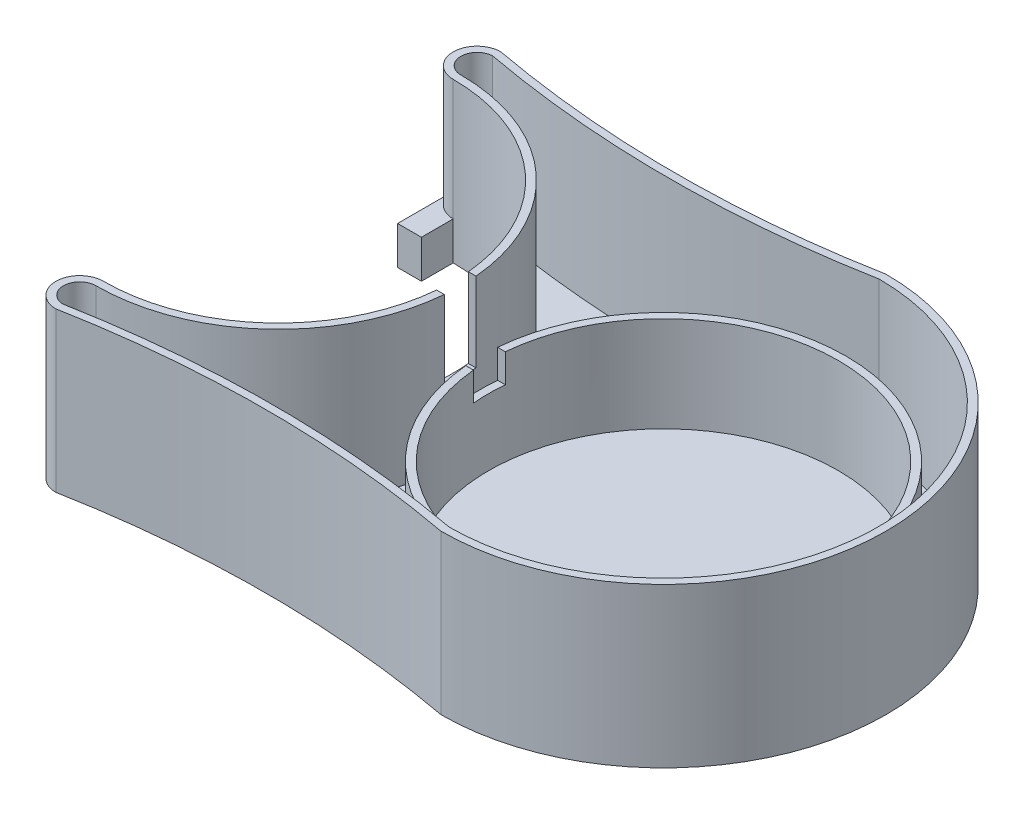
ISO-10303-21;
HEADER;
FILE_DESCRIPTION(('STEP AP214'),'2;1');
FILE_NAME('part.step','',(''),(''),'','','');
FILE_SCHEMA(('AUTOMOTIVE_DESIGN { 1 0 10303 214 1 1 1 1 }'));
ENDSEC;
DATA;
#1=APPLICATION_CONTEXT('core data for automotive mechanical design processes');
#2=APPLICATION_PROTOCOL_DEFINITION('international standard','automotive_design',2000,#1);
#3=PRODUCT_CONTEXT('',#1,'mechanical');
#4=PRODUCT('Part','Part','',(#3));
#5=PRODUCT_RELATED_PRODUCT_CATEGORY('part','',(#4));
#6=PRODUCT_DEFINITION_FORMATION('','',#4);
#7=PRODUCT_DEFINITION_CONTEXT('part definition',#1,'design');
#8=PRODUCT_DEFINITION('design','',#6,#7);
#9=PRODUCT_DEFINITION_SHAPE('','',#8);
#10=(LENGTH_UNIT() NAMED_UNIT(*) SI_UNIT(.MILLI.,.METRE.));
#11=(NAMED_UNIT(*) PLANE_ANGLE_UNIT() SI_UNIT($,.RADIAN.));
#12=(NAMED_UNIT(*) SI_UNIT($,.STERADIAN.) SOLID_ANGLE_UNIT());
#13=UNCERTAINTY_MEASURE_WITH_UNIT(LENGTH_MEASURE(1.E-05),#10,'distance_accuracy_value','');
#14=(GEOMETRIC_REPRESENTATION_CONTEXT(3) GLOBAL_UNCERTAINTY_ASSIGNED_CONTEXT((#13)) GLOBAL_UNIT_ASSIGNED_CONTEXT((#10,
#11,#12)) REPRESENTATION_CONTEXT('',''));
#15=CARTESIAN_POINT('',(0.,0.,0.));
#16=DIRECTION('',(0.,0.,1.));
#17=DIRECTION('',(1.,0.,0.));
#18=AXIS2_PLACEMENT_3D('',#15,#16,#17);
#19=CARTESIAN_POINT('',(-26.821298470149,0.,0.));
#20=DIRECTION('',(-1.,0.,0.));
#21=DIRECTION('',(0.,0.,1.));
#22=AXIS2_PLACEMENT_3D('',#19,#20,#21);
#23=PLANE('',#22);
#24=DIRECTION('',(0.,1.,0.));
#25=VECTOR('',#24,1.);
#26=CARTESIAN_POINT('',(-26.821298470149,0.,-22.5));
#27=LINE('',#26,#25);
#28=CARTESIAN_POINT('',(-26.821298470149,0.,-22.5));
#29=VERTEX_POINT('',#28);
#30=CARTESIAN_POINT('',(-26.821298470149,6.,-22.5));
#31=VERTEX_POINT('',#30);
#32=EDGE_CURVE('E50',#29,#31,#27,.T.);
#33=ORIENTED_EDGE('',*,*,#32,.T.);
#34=DIRECTION('',(0.,0.,1.));
#35=VECTOR('',#34,1.);
#36=CARTESIAN_POINT('',(-26.821298470149,6.,0.));
#37=LINE('',#36,#35);
#38=CARTESIAN_POINT('',(-26.821298470149,6.,-31.25));
#39=VERTEX_POINT('',#38);
#40=EDGE_CURVE('E63',#39,#31,#37,.T.);
#41=ORIENTED_EDGE('',*,*,#40,.F.);
#42=DIRECTION('',(0.,1.,0.));
#43=VECTOR('',#42,1.);
#44=CARTESIAN_POINT('',(-26.821298470149,0.,-31.25));
#45=LINE('',#44,#43);
#46=CARTESIAN_POINT('',(-26.821298470149,0.,-31.25));
#47=VERTEX_POINT('',#46);
#48=EDGE_CURVE('E12',#47,#39,#45,.T.);
#49=ORIENTED_EDGE('',*,*,#48,.F.);
#50=DIRECTION('',(0.,0.,1.));
#51=VECTOR('',#50,1.);
#52=CARTESIAN_POINT('',(-26.821298470149,0.,0.));
#53=LINE('',#52,#51);
#54=EDGE_CURVE('E114',#47,#29,#53,.T.);
#55=ORIENTED_EDGE('',*,*,#54,.T.);
#56=EDGE_LOOP('',(#33,#41,#49,#55));
#57=FACE_BOUND('',#56,.T.);
#58=ADVANCED_FACE('F47',(#57),#23,.T.);
#59=CARTESIAN_POINT('',(-23.071298470149,0.,-31.25));
#60=DIRECTION('',(0.,1.,0.));
#61=DIRECTION('',(0.,0.,1.));
#62=AXIS2_PLACEMENT_3D('',#59,#60,#61);
#63=CYLINDRICAL_SURFACE('',#62,3.75);
#64=CARTESIAN_POINT('',(-23.071298470149,6.,-31.25));
#65=DIRECTION('',(0.,1.,0.));
#66=DIRECTION('',(0.,0.,1.));
#67=AXIS2_PLACEMENT_3D('',#64,#65,#66);
#68=CIRCLE('',#67,3.75);
#69=CARTESIAN_POINT('',(-23.071298470149,6.,-27.5));
#70=VERTEX_POINT('',#69);
#71=EDGE_CURVE('E102',#39,#70,#68,.T.);
#72=ORIENTED_EDGE('',*,*,#71,.T.);
#73=DIRECTION('',(0.,1.,0.));
#74=VECTOR('',#73,1.);
#75=CARTESIAN_POINT('',(-23.071298470149,0.,-27.5));
#76=LINE('',#75,#74);
#77=CARTESIAN_POINT('',(-23.071298470149,0.,-27.5));
#78=VERTEX_POINT('',#77);
#79=EDGE_CURVE('E55',#78,#70,#76,.T.);
#80=ORIENTED_EDGE('',*,*,#79,.F.);
#81=CARTESIAN_POINT('',(-23.071298470149,0.,-31.25));
#82=DIRECTION('',(0.,1.,0.));
#83=DIRECTION('',(0.,0.,1.));
#84=AXIS2_PLACEMENT_3D('',#81,#82,#83);
#85=CIRCLE('',#84,3.75);
#86=EDGE_CURVE('E108',#47,#78,#85,.T.);
#87=ORIENTED_EDGE('',*,*,#86,.F.);
#88=ORIENTED_EDGE('',*,*,#48,.T.);
#89=EDGE_LOOP('',(#72,#80,#87,#88));
#90=FACE_BOUND('',#89,.T.);
#91=ADVANCED_FACE('F118',(#90),#63,.F.);
#92=CARTESIAN_POINT('',(-23.071298470149,0.,0.));
#93=DIRECTION('',(-1.,0.,0.));
#94=DIRECTION('',(0.,0.,1.));
#95=AXIS2_PLACEMENT_3D('',#92,#93,#94);
#96=PLANE('',#95);
#97=DIRECTION('',(0.,0.,1.));
#98=VECTOR('',#97,1.);
#99=CARTESIAN_POINT('',(-23.071298470149,6.,0.));
#100=LINE('',#99,#98);
#101=CARTESIAN_POINT('',(-23.071298470149,6.,-22.5));
#102=VERTEX_POINT('',#101);
#103=EDGE_CURVE('E88',#70,#102,#100,.T.);
#104=ORIENTED_EDGE('',*,*,#103,.T.);
#105=DIRECTION('',(0.,1.,0.));
#106=VECTOR('',#105,1.);
#107=CARTESIAN_POINT('',(-23.071298470149,0.,-22.5));
#108=LINE('',#107,#106);
#109=CARTESIAN_POINT('',(-23.071298470149,0.,-22.5));
#110=VERTEX_POINT('',#109);
#111=EDGE_CURVE('E99',#110,#102,#108,.T.);
#112=ORIENTED_EDGE('',*,*,#111,.F.);
#113=DIRECTION('',(0.,0.,1.));
#114=VECTOR('',#113,1.);
#115=CARTESIAN_POINT('',(-23.071298470149,0.,0.));
#116=LINE('',#115,#114);
#117=EDGE_CURVE('E111',#78,#110,#116,.T.);
#118=ORIENTED_EDGE('',*,*,#117,.F.);
#119=ORIENTED_EDGE('',*,*,#79,.T.);
#120=EDGE_LOOP('',(#104,#112,#118,#119));
#121=FACE_BOUND('',#120,.T.);
#122=ADVANCED_FACE('F97',(#121),#96,.F.);
#123=CARTESIAN_POINT('',(0.,0.,-22.5));
#124=DIRECTION('',(0.,0.,1.));
#125=DIRECTION('',(1.,0.,0.));
#126=AXIS2_PLACEMENT_3D('',#123,#124,#125);
#127=PLANE('',#126);
#128=ORIENTED_EDGE('',*,*,#111,.T.);
#129=DIRECTION('',(1.,0.,0.));
#130=VECTOR('',#129,1.);
#131=CARTESIAN_POINT('',(0.,6.,-22.5));
#132=LINE('',#131,#130);
#133=EDGE_CURVE('E85',#31,#102,#132,.T.);
#134=ORIENTED_EDGE('',*,*,#133,.F.);
#135=ORIENTED_EDGE('',*,*,#32,.F.);
#136=DIRECTION('',(1.,0.,0.));
#137=VECTOR('',#136,1.);
#138=CARTESIAN_POINT('',(0.,0.,-22.5));
#139=LINE('',#138,#137);
#140=EDGE_CURVE('E106',#29,#110,#139,.T.);
#141=ORIENTED_EDGE('',*,*,#140,.T.);
#142=EDGE_LOOP('',(#128,#134,#135,#141));
#143=FACE_BOUND('',#142,.T.);
#144=ADVANCED_FACE('F104',(#143),#127,.T.);
#145=CARTESIAN_POINT('',(0.,0.,0.));
#146=DIRECTION('',(0.,1.,0.));
#147=DIRECTION('',(0.,0.,1.));
#148=AXIS2_PLACEMENT_3D('',#145,#146,#147);
#149=PLANE('',#148);
#150=ORIENTED_EDGE('',*,*,#54,.F.);
#151=ORIENTED_EDGE('',*,*,#86,.T.);
#152=ORIENTED_EDGE('',*,*,#117,.T.);
#153=ORIENTED_EDGE('',*,*,#140,.F.);
#154=EDGE_LOOP('',(#150,#151,#152,#153));
#155=FACE_BOUND('',#154,.T.);
#156=ADVANCED_FACE('F121',(#155),#149,.F.);
#157=CARTESIAN_POINT('',(0.,6.,0.));
#158=DIRECTION('',(0.,1.,0.));
#159=DIRECTION('',(0.,0.,1.));
#160=AXIS2_PLACEMENT_3D('',#157,#158,#159);
#161=PLANE('',#160);
#162=ORIENTED_EDGE('',*,*,#40,.T.);
#163=ORIENTED_EDGE('',*,*,#133,.T.);
#164=ORIENTED_EDGE('',*,*,#103,.F.);
#165=ORIENTED_EDGE('',*,*,#71,.F.);
#166=EDGE_LOOP('',(#162,#163,#164,#165));
#167=FACE_BOUND('',#166,.T.);
#168=ADVANCED_FACE('F87',(#167),#161,.T.);
#169=CLOSED_SHELL('',(#58,#91,#122,#144,#156,#168));
#170=MANIFOLD_SOLID_BREP('B2',#169);
#171=CARTESIAN_POINT('',(-26.821298470149,0.,0.));
#172=DIRECTION('',(1.,0.,0.));
#173=DIRECTION('',(0.,0.,-1.));
#174=AXIS2_PLACEMENT_3D('',#171,#172,#173);
#175=PLANE('',#174);
#176=DIRECTION('',(0.,0.,-1.));
#177=VECTOR('',#176,1.);
#178=CARTESIAN_POINT('',(-26.821298470149,6.,0.));
#179=LINE('',#178,#177);
#180=CARTESIAN_POINT('',(-26.821298470149,6.,31.25));
#181=VERTEX_POINT('',#180);
#182=CARTESIAN_POINT('',(-26.821298470149,6.,22.5));
#183=VERTEX_POINT('',#182);
#184=EDGE_CURVE('E204',#181,#183,#179,.T.);
#185=ORIENTED_EDGE('',*,*,#184,.T.);
#186=DIRECTION('',(0.,1.,0.));
#187=VECTOR('',#186,1.);
#188=CARTESIAN_POINT('',(-26.821298470149,0.,22.5));
#189=LINE('',#188,#187);
#190=CARTESIAN_POINT('',(-26.821298470149,0.,22.5));
#191=VERTEX_POINT('',#190);
#192=EDGE_CURVE('E45',#191,#183,#189,.T.);
#193=ORIENTED_EDGE('',*,*,#192,.F.);
#194=DIRECTION('',(0.,0.,-1.));
#195=VECTOR('',#194,1.);
#196=CARTESIAN_POINT('',(-26.821298470149,0.,0.));
#197=LINE('',#196,#195);
#198=CARTESIAN_POINT('',(-26.821298470149,0.,31.25));
#199=VERTEX_POINT('',#198);
#200=EDGE_CURVE('E254',#199,#191,#197,.T.);
#201=ORIENTED_EDGE('',*,*,#200,.F.);
#202=DIRECTION('',(0.,1.,0.));
#203=VECTOR('',#202,1.);
#204=CARTESIAN_POINT('',(-26.821298470149,0.,31.25));
#205=LINE('',#204,#203);
#206=EDGE_CURVE('E191',#199,#181,#205,.T.);
#207=ORIENTED_EDGE('',*,*,#206,.T.);
#208=EDGE_LOOP('',(#185,#193,#201,#207));
#209=FACE_BOUND('',#208,.T.);
#210=ADVANCED_FACE('F188',(#209),#175,.F.);
#211=CARTESIAN_POINT('',(0.,0.,22.5));
#212=DIRECTION('',(0.,0.,1.));
#213=DIRECTION('',(1.,0.,0.));
#214=AXIS2_PLACEMENT_3D('',#211,#212,#213);
#215=PLANE('',#214);
#216=DIRECTION('',(1.,0.,0.));
#217=VECTOR('',#216,1.);
#218=CARTESIAN_POINT('',(0.,6.,22.5));
#219=LINE('',#218,#217);
#220=CARTESIAN_POINT('',(-23.071298470149,6.,22.5));
#221=VERTEX_POINT('',#220);
#222=EDGE_CURVE('E243',#183,#221,#219,.T.);
#223=ORIENTED_EDGE('',*,*,#222,.T.);
#224=DIRECTION('',(0.,1.,0.));
#225=VECTOR('',#224,1.);
#226=CARTESIAN_POINT('',(-23.071298470149,0.,22.5));
#227=LINE('',#226,#225);
#228=CARTESIAN_POINT('',(-23.071298470149,0.,22.5));
#229=VERTEX_POINT('',#228);
#230=EDGE_CURVE('E196',#229,#221,#227,.T.);
#231=ORIENTED_EDGE('',*,*,#230,.F.);
#232=DIRECTION('',(1.,0.,0.));
#233=VECTOR('',#232,1.);
#234=CARTESIAN_POINT('',(0.,0.,22.5));
#235=LINE('',#234,#233);
#236=EDGE_CURVE('E211',#191,#229,#235,.T.);
#237=ORIENTED_EDGE('',*,*,#236,.F.);
#238=ORIENTED_EDGE('',*,*,#192,.T.);
#239=EDGE_LOOP('',(#223,#231,#237,#238));
#240=FACE_BOUND('',#239,.T.);
#241=ADVANCED_FACE('F257',(#240),#215,.F.);
#242=CARTESIAN_POINT('',(-23.071298470149,0.,0.));
#243=DIRECTION('',(1.,0.,0.));
#244=DIRECTION('',(0.,0.,-1.));
#245=AXIS2_PLACEMENT_3D('',#242,#243,#244);
#246=PLANE('',#245);
#247=ORIENTED_EDGE('',*,*,#230,.T.);
#248=DIRECTION('',(0.,0.,-1.));
#249=VECTOR('',#248,1.);
#250=CARTESIAN_POINT('',(-23.071298470149,6.,0.));
#251=LINE('',#250,#249);
#252=CARTESIAN_POINT('',(-23.071298470149,6.,27.5));
#253=VERTEX_POINT('',#252);
#254=EDGE_CURVE('E230',#253,#221,#251,.T.);
#255=ORIENTED_EDGE('',*,*,#254,.F.);
#256=DIRECTION('',(0.,1.,0.));
#257=VECTOR('',#256,1.);
#258=CARTESIAN_POINT('',(-23.071298470149,0.,27.5));
#259=LINE('',#258,#257);
#260=CARTESIAN_POINT('',(-23.071298470149,0.,27.5));
#261=VERTEX_POINT('',#260);
#262=EDGE_CURVE('E241',#261,#253,#259,.T.);
#263=ORIENTED_EDGE('',*,*,#262,.F.);
#264=DIRECTION('',(0.,0.,-1.));
#265=VECTOR('',#264,1.);
#266=CARTESIAN_POINT('',(-23.071298470149,0.,0.));
#267=LINE('',#266,#265);
#268=EDGE_CURVE('E251',#261,#229,#267,.T.);
#269=ORIENTED_EDGE('',*,*,#268,.T.);
#270=EDGE_LOOP('',(#247,#255,#263,#269));
#271=FACE_BOUND('',#270,.T.);
#272=ADVANCED_FACE('F239',(#271),#246,.T.);
#273=CARTESIAN_POINT('',(-23.071298470149,0.,31.25));
#274=DIRECTION('',(0.,1.,0.));
#275=DIRECTION('',(0.,0.,1.));
#276=AXIS2_PLACEMENT_3D('',#273,#274,#275);
#277=CYLINDRICAL_SURFACE('',#276,3.75);
#278=CARTESIAN_POINT('',(-23.071298470149,6.,31.25));
#279=DIRECTION('',(0.,1.,0.));
#280=DIRECTION('',(0.,0.,1.));
#281=AXIS2_PLACEMENT_3D('',#278,#279,#280);
#282=CIRCLE('',#281,3.75);
#283=EDGE_CURVE('E227',#253,#181,#282,.T.);
#284=ORIENTED_EDGE('',*,*,#283,.T.);
#285=ORIENTED_EDGE('',*,*,#206,.F.);
#286=CARTESIAN_POINT('',(-23.071298470149,0.,31.25));
#287=DIRECTION('',(0.,1.,0.));
#288=DIRECTION('',(0.,0.,1.));
#289=AXIS2_PLACEMENT_3D('',#286,#287,#288);
#290=CIRCLE('',#289,3.75);
#291=EDGE_CURVE('E246',#261,#199,#290,.T.);
#292=ORIENTED_EDGE('',*,*,#291,.F.);
#293=ORIENTED_EDGE('',*,*,#262,.T.);
#294=EDGE_LOOP('',(#284,#285,#292,#293));
#295=FACE_BOUND('',#294,.T.);
#296=ADVANCED_FACE('F245',(#295),#277,.F.);
#297=CARTESIAN_POINT('',(0.,0.,0.));
#298=DIRECTION('',(0.,1.,0.));
#299=DIRECTION('',(0.,0.,1.));
#300=AXIS2_PLACEMENT_3D('',#297,#298,#299);
#301=PLANE('',#300);
#302=ORIENTED_EDGE('',*,*,#200,.T.);
#303=ORIENTED_EDGE('',*,*,#236,.T.);
#304=ORIENTED_EDGE('',*,*,#268,.F.);
#305=ORIENTED_EDGE('',*,*,#291,.T.);
#306=EDGE_LOOP('',(#302,#303,#304,#305));
#307=FACE_BOUND('',#306,.T.);
#308=ADVANCED_FACE('F262',(#307),#301,.F.);
#309=CARTESIAN_POINT('',(0.,6.,0.));
#310=DIRECTION('',(0.,1.,0.));
#311=DIRECTION('',(0.,0.,1.));
#312=AXIS2_PLACEMENT_3D('',#309,#310,#311);
#313=PLANE('',#312);
#314=ORIENTED_EDGE('',*,*,#283,.F.);
#315=ORIENTED_EDGE('',*,*,#254,.T.);
#316=ORIENTED_EDGE('',*,*,#222,.F.);
#317=ORIENTED_EDGE('',*,*,#184,.F.);
#318=EDGE_LOOP('',(#314,#315,#316,#317));
#319=FACE_BOUND('',#318,.T.);
#320=ADVANCED_FACE('F229',(#319),#313,.T.);
#321=CLOSED_SHELL('',(#210,#241,#272,#296,#308,#320));
#322=MANIFOLD_SOLID_BREP('B6',#321);
#323=CARTESIAN_POINT('',(37.5,25.,0.));
#324=DIRECTION('',(0.,-1.,0.));
#325=DIRECTION('',(0.,0.,-1.));
#326=AXIS2_PLACEMENT_3D('',#323,#324,#325);
#327=CYLINDRICAL_SURFACE('',#326,27.5);
#328=DIRECTION('',(0.,-1.,0.));
#329=VECTOR('',#328,1.);
#330=CARTESIAN_POINT('',(10.1138721247417,25.,2.5));
#331=LINE('',#330,#329);
#332=CARTESIAN_POINT('',(10.1138721247417,17.,2.5));
#333=VERTEX_POINT('',#332);
#334=CARTESIAN_POINT('',(10.1138721247417,12.5,2.5));
#335=VERTEX_POINT('',#334);
#336=EDGE_CURVE('E556',#333,#335,#331,.T.);
#337=ORIENTED_EDGE('',*,*,#336,.F.);
#338=CARTESIAN_POINT('',(37.5,17.,0.));
#339=DIRECTION('',(0.,1.,0.));
#340=DIRECTION('',(0.,0.,1.));
#341=AXIS2_PLACEMENT_3D('',#338,#339,#340);
#342=CIRCLE('',#341,27.5);
#343=CARTESIAN_POINT('',(10.1138721247417,17.,-2.5));
#344=VERTEX_POINT('',#343);
#345=EDGE_CURVE('E549',#333,#344,#342,.T.);
#346=ORIENTED_EDGE('',*,*,#345,.T.);
#347=DIRECTION('',(0.,-1.,0.));
#348=VECTOR('',#347,1.);
#349=CARTESIAN_POINT('',(10.1138721247417,25.,-2.5));
#350=LINE('',#349,#348);
#351=CARTESIAN_POINT('',(10.1138721247417,12.5,-2.5));
#352=VERTEX_POINT('',#351);
#353=EDGE_CURVE('E343',#352,#344,#350,.F.);
#354=ORIENTED_EDGE('',*,*,#353,.F.);
#355=CARTESIAN_POINT('',(37.5,12.5,0.));
#356=DIRECTION('',(0.,1.,0.));
#357=DIRECTION('',(0.,0.,1.));
#358=AXIS2_PLACEMENT_3D('',#355,#356,#357);
#359=CIRCLE('',#358,27.5);
#360=EDGE_CURVE('E567',#352,#335,#359,.T.);
#361=ORIENTED_EDGE('',*,*,#360,.T.);
#362=EDGE_LOOP('',(#337,#346,#354,#361));
#363=FACE_BOUND('',#362,.T.);
#364=CARTESIAN_POINT('',(37.5,2.,0.));
#365=DIRECTION('',(0.,-1.,0.));
#366=DIRECTION('',(0.,0.,-1.));
#367=AXIS2_PLACEMENT_3D('',#364,#365,#366);
#368=CIRCLE('',#367,27.5);
#369=CARTESIAN_POINT('',(37.5,2.,-27.5));
#370=VERTEX_POINT('',#369);
#371=EDGE_CURVE('E550',#370,#370,#368,.T.);
#372=ORIENTED_EDGE('',*,*,#371,.T.);
#373=EDGE_LOOP('',(#372));
#374=FACE_BOUND('',#373,.T.);
#375=ADVANCED_FACE('F320',(#363,#374),#327,.F.);
#376=CARTESIAN_POINT('',(37.5,25.,0.));
#377=DIRECTION('',(0.,-1.,0.));
#378=DIRECTION('',(0.,0.,-1.));
#379=AXIS2_PLACEMENT_3D('',#376,#377,#378);
#380=CYLINDRICAL_SURFACE('',#379,28.7);
#381=CARTESIAN_POINT('',(37.5,17.,0.));
#382=DIRECTION('',(0.,1.,0.));
#383=DIRECTION('',(0.,0.,1.));
#384=AXIS2_PLACEMENT_3D('',#381,#382,#383);
#385=CIRCLE('',#384,28.7);
#386=CARTESIAN_POINT('',(8.90909235438654,17.,2.5));
#387=VERTEX_POINT('',#386);
#388=CARTESIAN_POINT('',(8.90909235438654,17.,-2.5));
#389=VERTEX_POINT('',#388);
#390=EDGE_CURVE('E546',#387,#389,#385,.T.);
#391=ORIENTED_EDGE('',*,*,#390,.F.);
#392=DIRECTION('',(0.,-1.,0.));
#393=VECTOR('',#392,1.);
#394=CARTESIAN_POINT('',(8.90909235438654,25.,2.5));
#395=LINE('',#394,#393);
#396=CARTESIAN_POINT('',(8.90909235438654,12.5,2.5));
#397=VERTEX_POINT('',#396);
#398=EDGE_CURVE('E559',#387,#397,#395,.T.);
#399=ORIENTED_EDGE('',*,*,#398,.T.);
#400=CARTESIAN_POINT('',(37.5,12.5,0.));
#401=DIRECTION('',(0.,1.,0.));
#402=DIRECTION('',(0.,0.,1.));
#403=AXIS2_PLACEMENT_3D('',#400,#401,#402);
#404=CIRCLE('',#403,28.7);
#405=CARTESIAN_POINT('',(8.90909235438654,12.5,-2.5));
#406=VERTEX_POINT('',#405);
#407=EDGE_CURVE('E641',#406,#397,#404,.T.);
#408=ORIENTED_EDGE('',*,*,#407,.F.);
#409=DIRECTION('',(0.,-1.,0.));
#410=VECTOR('',#409,1.);
#411=CARTESIAN_POINT('',(8.90909235438654,25.,-2.5));
#412=LINE('',#411,#410);
#413=EDGE_CURVE('E710',#406,#389,#412,.F.);
#414=ORIENTED_EDGE('',*,*,#413,.T.);
#415=EDGE_LOOP('',(#391,#399,#408,#414));
#416=FACE_BOUND('',#415,.T.);
#417=CARTESIAN_POINT('',(37.5,1.2,0.));
#418=DIRECTION('',(0.,1.,0.));
#419=DIRECTION('',(0.,0.,1.));
#420=AXIS2_PLACEMENT_3D('',#417,#418,#419);
#421=CIRCLE('',#420,28.7);
#422=CARTESIAN_POINT('',(37.5,1.2,28.7));
#423=VERTEX_POINT('',#422);
#424=EDGE_CURVE('E571',#423,#423,#421,.T.);
#425=ORIENTED_EDGE('',*,*,#424,.T.);
#426=EDGE_LOOP('',(#425));
#427=FACE_BOUND('',#426,.T.);
#428=ADVANCED_FACE('F658',(#416,#427),#380,.T.);
#429=CARTESIAN_POINT('',(22.3571753824628,25.,-98.5983653509891));
#430=DIRECTION('',(0.,1.,0.));
#431=DIRECTION('',(0.,0.,1.));
#432=AXIS2_PLACEMENT_3D('',#429,#430,#431);
#433=PLANE('',#432);
#434=DIRECTION('',(1.,0.,0.));
#435=VECTOR('',#434,1.);
#436=CARTESIAN_POINT('',(0.435559147426041,25.,2.5));
#437=LINE('',#436,#435);
#438=CARTESIAN_POINT('',(4.31482940510931,25.,2.5));
#439=VERTEX_POINT('',#438);
#440=CARTESIAN_POINT('',(5.5196091754645,25.,2.5));
#441=VERTEX_POINT('',#440);
#442=EDGE_CURVE('E478',#439,#441,#437,.T.);
#443=ORIENTED_EDGE('',*,*,#442,.F.);
#444=CARTESIAN_POINT('',(-23.071298470149,25.,0.));
#445=DIRECTION('',(0.,-1.,0.));
#446=DIRECTION('',(0.,0.,1.));
#447=AXIS2_PLACEMENT_3D('',#444,#445,#446);
#448=CIRCLE('',#447,27.5);
#449=CARTESIAN_POINT('',(-23.071298470149,25.,27.5));
#450=VERTEX_POINT('',#449);
#451=EDGE_CURVE('E506',#439,#450,#448,.T.);
#452=ORIENTED_EDGE('',*,*,#451,.T.);
#453=CARTESIAN_POINT('',(-23.071298470149,25.,31.25));
#454=DIRECTION('',(0.,1.,0.));
#455=DIRECTION('',(0.,0.,1.));
#456=AXIS2_PLACEMENT_3D('',#453,#454,#455);
#457=CIRCLE('',#456,3.75);
#458=CARTESIAN_POINT('',(-23.071298470149,25.,35.));
#459=VERTEX_POINT('',#458);
#460=EDGE_CURVE('E508',#450,#459,#457,.T.);
#461=ORIENTED_EDGE('',*,*,#460,.T.);
#462=CARTESIAN_POINT('',(7.21435076492552,25.,197.196730701978));
#463=DIRECTION('',(0.,-1.,0.));
#464=DIRECTION('',(0.,0.,-1.));
#465=AXIS2_PLACEMENT_3D('',#462,#463,#464);
#466=CIRCLE('',#465,165.);
#467=CARTESIAN_POINT('',(37.5,25.,35.));
#468=VERTEX_POINT('',#467);
#469=EDGE_CURVE('E510',#459,#468,#466,.T.);
#470=ORIENTED_EDGE('',*,*,#469,.T.);
#471=CARTESIAN_POINT('',(37.5,25.,0.));
#472=DIRECTION('',(0.,1.,0.));
#473=DIRECTION('',(0.,0.,-1.));
#474=AXIS2_PLACEMENT_3D('',#471,#472,#473);
#475=CIRCLE('',#474,35.);
#476=CARTESIAN_POINT('',(37.5,25.,-35.));
#477=VERTEX_POINT('',#476);
#478=EDGE_CURVE('E512',#468,#477,#475,.T.);
#479=ORIENTED_EDGE('',*,*,#478,.T.);
#480=CARTESIAN_POINT('',(7.21435076492552,25.,-197.196730701978));
#481=DIRECTION('',(0.,-1.,0.));
#482=DIRECTION('',(0.,0.,1.));
#483=AXIS2_PLACEMENT_3D('',#480,#481,#482);
#484=CIRCLE('',#483,165.);
#485=CARTESIAN_POINT('',(-23.071298470149,25.,-35.));
#486=VERTEX_POINT('',#485);
#487=EDGE_CURVE('E500',#477,#486,#484,.T.);
#488=ORIENTED_EDGE('',*,*,#487,.T.);
#489=CARTESIAN_POINT('',(-23.071298470149,25.,-31.25));
#490=DIRECTION('',(0.,1.,0.));
#491=DIRECTION('',(0.,0.,1.));
#492=AXIS2_PLACEMENT_3D('',#489,#490,#491);
#493=CIRCLE('',#492,3.75);
#494=CARTESIAN_POINT('',(-23.071298470149,25.,-27.5));
#495=VERTEX_POINT('',#494);
#496=EDGE_CURVE('E503',#486,#495,#493,.T.);
#497=ORIENTED_EDGE('',*,*,#496,.T.);
#498=CARTESIAN_POINT('',(4.31482940510931,25.,-2.5));
#499=VERTEX_POINT('',#498);
#500=EDGE_CURVE('E477',#495,#499,#448,.T.);
#501=ORIENTED_EDGE('',*,*,#500,.T.);
#502=DIRECTION('',(-1.,0.,0.));
#503=VECTOR('',#502,1.);
#504=CARTESIAN_POINT('',(0.43555914742604,25.,-2.5));
#505=LINE('',#504,#503);
#506=CARTESIAN_POINT('',(5.5196091754645,25.,-2.5));
#507=VERTEX_POINT('',#506);
#508=EDGE_CURVE('E461',#507,#499,#505,.T.);
#509=ORIENTED_EDGE('',*,*,#508,.F.);
#510=CARTESIAN_POINT('',(-23.071298470149,25.,0.));
#511=DIRECTION('',(0.,1.,0.));
#512=DIRECTION('',(0.,0.,1.));
#513=AXIS2_PLACEMENT_3D('',#510,#511,#512);
#514=CIRCLE('',#513,28.7);
#515=CARTESIAN_POINT('',(-23.071298470149,25.,-28.7));
#516=VERTEX_POINT('',#515);
#517=EDGE_CURVE('E475',#516,#507,#514,.F.);
#518=ORIENTED_EDGE('',*,*,#517,.F.);
#519=CARTESIAN_POINT('',(-23.071298470149,25.,-31.25));
#520=DIRECTION('',(0.,1.,0.));
#521=DIRECTION('',(0.,0.,1.));
#522=AXIS2_PLACEMENT_3D('',#519,#520,#521);
#523=CIRCLE('',#522,2.55);
#524=CARTESIAN_POINT('',(-23.1715660079683,25.,-33.7980279474252));
#525=VERTEX_POINT('',#524);
#526=EDGE_CURVE('E491',#525,#516,#523,.T.);
#527=ORIENTED_EDGE('',*,*,#526,.F.);
#528=CARTESIAN_POINT('',(7.21435076492552,25.,-197.196730701978));
#529=DIRECTION('',(0.,1.,0.));
#530=DIRECTION('',(0.,0.,1.));
#531=AXIS2_PLACEMENT_3D('',#528,#529,#530);
#532=CIRCLE('',#531,166.2);
#533=CARTESIAN_POINT('',(37.6099096134196,25.,-33.7998212994814));
#534=VERTEX_POINT('',#533);
#535=EDGE_CURVE('E584',#534,#525,#532,.F.);
#536=ORIENTED_EDGE('',*,*,#535,.F.);
#537=CARTESIAN_POINT('',(37.5,25.,0.));
#538=DIRECTION('',(0.,1.,0.));
#539=DIRECTION('',(0.,0.,1.));
#540=AXIS2_PLACEMENT_3D('',#537,#538,#539);
#541=CIRCLE('',#540,33.8);
#542=CARTESIAN_POINT('',(37.6099096134196,25.,33.7998212994814));
#543=VERTEX_POINT('',#542);
#544=EDGE_CURVE('E497',#543,#534,#541,.T.);
#545=ORIENTED_EDGE('',*,*,#544,.F.);
#546=CARTESIAN_POINT('',(7.21435076492552,25.,197.196730701978));
#547=DIRECTION('',(0.,1.,0.));
#548=DIRECTION('',(0.,0.,1.));
#549=AXIS2_PLACEMENT_3D('',#546,#547,#548);
#550=CIRCLE('',#549,166.2);
#551=CARTESIAN_POINT('',(-23.1715660079683,25.,33.7980279474252));
#552=VERTEX_POINT('',#551);
#553=EDGE_CURVE('E489',#552,#543,#550,.F.);
#554=ORIENTED_EDGE('',*,*,#553,.F.);
#555=CARTESIAN_POINT('',(-23.071298470149,25.,31.25));
#556=DIRECTION('',(0.,1.,0.));
#557=DIRECTION('',(0.,0.,1.));
#558=AXIS2_PLACEMENT_3D('',#555,#556,#557);
#559=CIRCLE('',#558,2.55);
#560=CARTESIAN_POINT('',(-23.071298470149,25.,28.7));
#561=VERTEX_POINT('',#560);
#562=EDGE_CURVE('E486',#561,#552,#559,.T.);
#563=ORIENTED_EDGE('',*,*,#562,.F.);
#564=EDGE_CURVE('E487',#441,#561,#514,.F.);
#565=ORIENTED_EDGE('',*,*,#564,.F.);
#566=EDGE_LOOP('',(#443,#452,#461,#470,#479,#488,#497,#501,#509,#518,#527,#536,#545,#554,#563,#565));
#567=FACE_BOUND('',#566,.T.);
#568=ADVANCED_FACE('F473',(#567),#433,.T.);
#569=CARTESIAN_POINT('',(22.3571753824628,0.,-98.5983653509891));
#570=DIRECTION('',(0.,1.,0.));
#571=DIRECTION('',(0.,0.,1.));
#572=AXIS2_PLACEMENT_3D('',#569,#570,#571);
#573=PLANE('',#572);
#574=CARTESIAN_POINT('',(7.21435076492552,0.,-197.196730701978));
#575=DIRECTION('',(0.,-1.,0.));
#576=DIRECTION('',(0.,0.,1.));
#577=AXIS2_PLACEMENT_3D('',#574,#575,#576);
#578=CIRCLE('',#577,165.);
#579=CARTESIAN_POINT('',(37.5,0.,-35.));
#580=VERTEX_POINT('',#579);
#581=CARTESIAN_POINT('',(-23.071298470149,0.,-35.));
#582=VERTEX_POINT('',#581);
#583=EDGE_CURVE('E515',#580,#582,#578,.T.);
#584=ORIENTED_EDGE('',*,*,#583,.F.);
#585=CARTESIAN_POINT('',(37.5,0.,0.));
#586=DIRECTION('',(0.,1.,0.));
#587=DIRECTION('',(0.,0.,-1.));
#588=AXIS2_PLACEMENT_3D('',#585,#586,#587);
#589=CIRCLE('',#588,35.);
#590=CARTESIAN_POINT('',(37.5,0.,35.));
#591=VERTEX_POINT('',#590);
#592=EDGE_CURVE('E504',#591,#580,#589,.T.);
#593=ORIENTED_EDGE('',*,*,#592,.F.);
#594=CARTESIAN_POINT('',(7.21435076492552,0.,197.196730701978));
#595=DIRECTION('',(0.,-1.,0.));
#596=DIRECTION('',(0.,0.,-1.));
#597=AXIS2_PLACEMENT_3D('',#594,#595,#596);
#598=CIRCLE('',#597,165.);
#599=CARTESIAN_POINT('',(-23.071298470149,0.,35.));
#600=VERTEX_POINT('',#599);
#601=EDGE_CURVE('E525',#600,#591,#598,.T.);
#602=ORIENTED_EDGE('',*,*,#601,.F.);
#603=CARTESIAN_POINT('',(-23.071298470149,0.,31.25));
#604=DIRECTION('',(0.,1.,0.));
#605=DIRECTION('',(0.,0.,1.));
#606=AXIS2_PLACEMENT_3D('',#603,#604,#605);
#607=CIRCLE('',#606,3.75);
#608=CARTESIAN_POINT('',(-23.071298470149,0.,27.5));
#609=VERTEX_POINT('',#608);
#610=EDGE_CURVE('E523',#609,#600,#607,.T.);
#611=ORIENTED_EDGE('',*,*,#610,.F.);
#612=CARTESIAN_POINT('',(-23.071298470149,0.,0.));
#613=DIRECTION('',(0.,-1.,0.));
#614=DIRECTION('',(0.,0.,1.));
#615=AXIS2_PLACEMENT_3D('',#612,#613,#614);
#616=CIRCLE('',#615,27.5);
#617=CARTESIAN_POINT('',(-23.071298470149,0.,-27.5));
#618=VERTEX_POINT('',#617);
#619=EDGE_CURVE('E521',#618,#609,#616,.T.);
#620=ORIENTED_EDGE('',*,*,#619,.F.);
#621=CARTESIAN_POINT('',(-23.071298470149,0.,-31.25));
#622=DIRECTION('',(0.,1.,0.));
#623=DIRECTION('',(0.,0.,1.));
#624=AXIS2_PLACEMENT_3D('',#621,#622,#623);
#625=CIRCLE('',#624,3.75);
#626=EDGE_CURVE('E518',#582,#618,#625,.T.);
#627=ORIENTED_EDGE('',*,*,#626,.F.);
#628=EDGE_LOOP('',(#584,#593,#602,#611,#620,#627));
#629=FACE_BOUND('',#628,.T.);
#630=ADVANCED_FACE('F669',(#629),#573,.F.);
#631=CARTESIAN_POINT('',(7.21435076492552,25.,-197.196730701978));
#632=DIRECTION('',(0.,-1.,0.));
#633=DIRECTION('',(0.,0.,-1.));
#634=AXIS2_PLACEMENT_3D('',#631,#632,#633);
#635=CYLINDRICAL_SURFACE('',#634,165.);
#636=ORIENTED_EDGE('',*,*,#583,.T.);
#637=DIRECTION('',(0.,-1.,0.));
#638=VECTOR('',#637,1.);
#639=CARTESIAN_POINT('',(-23.071298470149,25.,-35.));
#640=LINE('',#639,#638);
#641=EDGE_CURVE('E542',#486,#582,#640,.T.);
#642=ORIENTED_EDGE('',*,*,#641,.F.);
#643=ORIENTED_EDGE('',*,*,#487,.F.);
#644=DIRECTION('',(0.,-1.,0.));
#645=VECTOR('',#644,1.);
#646=CARTESIAN_POINT('',(37.5,25.,-35.));
#647=LINE('',#646,#645);
#648=EDGE_CURVE('E514',#477,#580,#647,.T.);
#649=ORIENTED_EDGE('',*,*,#648,.T.);
#650=EDGE_LOOP('',(#636,#642,#643,#649));
#651=FACE_BOUND('',#650,.T.);
#652=ADVANCED_FACE('F322',(#651),#635,.F.);
#653=CARTESIAN_POINT('',(-23.071298470149,25.,-31.25));
#654=DIRECTION('',(0.,-1.,0.));
#655=DIRECTION('',(0.,0.,-1.));
#656=AXIS2_PLACEMENT_3D('',#653,#654,#655);
#657=CYLINDRICAL_SURFACE('',#656,3.75);
#658=ORIENTED_EDGE('',*,*,#626,.T.);
#659=DIRECTION('',(0.,-1.,0.));
#660=VECTOR('',#659,1.);
#661=CARTESIAN_POINT('',(-23.071298470149,25.,-27.5));
#662=LINE('',#661,#660);
#663=EDGE_CURVE('E539',#495,#618,#662,.T.);
#664=ORIENTED_EDGE('',*,*,#663,.F.);
#665=ORIENTED_EDGE('',*,*,#496,.F.);
#666=ORIENTED_EDGE('',*,*,#641,.T.);
#667=EDGE_LOOP('',(#658,#664,#665,#666));
#668=FACE_BOUND('',#667,.T.);
#669=ADVANCED_FACE('F687',(#668),#657,.T.);
#670=CARTESIAN_POINT('',(-23.071298470149,25.,0.));
#671=DIRECTION('',(0.,-1.,0.));
#672=DIRECTION('',(0.,0.,-1.));
#673=AXIS2_PLACEMENT_3D('',#670,#671,#672);
#674=CYLINDRICAL_SURFACE('',#673,27.5);
#675=ORIENTED_EDGE('',*,*,#451,.F.);
#676=DIRECTION('',(0.,-1.,0.));
#677=VECTOR('',#676,1.);
#678=CARTESIAN_POINT('',(4.31482940510931,25.,2.5));
#679=LINE('',#678,#677);
#680=CARTESIAN_POINT('',(4.31482940510931,12.5,2.5));
#681=VERTEX_POINT('',#680);
#682=EDGE_CURVE('E633',#439,#681,#679,.T.);
#683=ORIENTED_EDGE('',*,*,#682,.T.);
#684=CARTESIAN_POINT('',(-23.071298470149,12.5,0.));
#685=DIRECTION('',(0.,1.,0.));
#686=DIRECTION('',(0.,0.,1.));
#687=AXIS2_PLACEMENT_3D('',#684,#685,#686);
#688=CIRCLE('',#687,27.5);
#689=CARTESIAN_POINT('',(4.31482940510931,12.5,-2.5));
#690=VERTEX_POINT('',#689);
#691=EDGE_CURVE('E636',#690,#681,#688,.F.);
#692=ORIENTED_EDGE('',*,*,#691,.F.);
#693=DIRECTION('',(0.,-1.,0.));
#694=VECTOR('',#693,1.);
#695=CARTESIAN_POINT('',(4.31482940510931,25.,-2.5));
#696=LINE('',#695,#694);
#697=EDGE_CURVE('E467',#690,#499,#696,.F.);
#698=ORIENTED_EDGE('',*,*,#697,.T.);
#699=ORIENTED_EDGE('',*,*,#500,.F.);
#700=ORIENTED_EDGE('',*,*,#663,.T.);
#701=ORIENTED_EDGE('',*,*,#619,.T.);
#702=DIRECTION('',(0.,-1.,0.));
#703=VECTOR('',#702,1.);
#704=CARTESIAN_POINT('',(-23.071298470149,25.,27.5));
#705=LINE('',#704,#703);
#706=EDGE_CURVE('E536',#450,#609,#705,.T.);
#707=ORIENTED_EDGE('',*,*,#706,.F.);
#708=EDGE_LOOP('',(#675,#683,#692,#698,#699,#700,#701,#707));
#709=FACE_BOUND('',#708,.T.);
#710=ADVANCED_FACE('F684',(#709),#674,.F.);
#711=CARTESIAN_POINT('',(-23.071298470149,25.,31.25));
#712=DIRECTION('',(0.,-1.,0.));
#713=DIRECTION('',(0.,0.,-1.));
#714=AXIS2_PLACEMENT_3D('',#711,#712,#713);
#715=CYLINDRICAL_SURFACE('',#714,3.75);
#716=ORIENTED_EDGE('',*,*,#610,.T.);
#717=DIRECTION('',(0.,-1.,0.));
#718=VECTOR('',#717,1.);
#719=CARTESIAN_POINT('',(-23.071298470149,25.,35.));
#720=LINE('',#719,#718);
#721=EDGE_CURVE('E533',#459,#600,#720,.T.);
#722=ORIENTED_EDGE('',*,*,#721,.F.);
#723=ORIENTED_EDGE('',*,*,#460,.F.);
#724=ORIENTED_EDGE('',*,*,#706,.T.);
#725=EDGE_LOOP('',(#716,#722,#723,#724));
#726=FACE_BOUND('',#725,.T.);
#727=ADVANCED_FACE('F680',(#726),#715,.T.);
#728=CARTESIAN_POINT('',(7.21435076492552,25.,197.196730701978));
#729=DIRECTION('',(0.,-1.,0.));
#730=DIRECTION('',(0.,0.,-1.));
#731=AXIS2_PLACEMENT_3D('',#728,#729,#730);
#732=CYLINDRICAL_SURFACE('',#731,165.);
#733=ORIENTED_EDGE('',*,*,#601,.T.);
#734=DIRECTION('',(0.,-1.,0.));
#735=VECTOR('',#734,1.);
#736=CARTESIAN_POINT('',(37.5,25.,35.));
#737=LINE('',#736,#735);
#738=EDGE_CURVE('E530',#468,#591,#737,.T.);
#739=ORIENTED_EDGE('',*,*,#738,.F.);
#740=ORIENTED_EDGE('',*,*,#469,.F.);
#741=ORIENTED_EDGE('',*,*,#721,.T.);
#742=EDGE_LOOP('',(#733,#739,#740,#741));
#743=FACE_BOUND('',#742,.T.);
#744=ADVANCED_FACE('F676',(#743),#732,.F.);
#745=CARTESIAN_POINT('',(37.5,25.,0.));
#746=DIRECTION('',(0.,-1.,0.));
#747=DIRECTION('',(0.,0.,-1.));
#748=AXIS2_PLACEMENT_3D('',#745,#746,#747);
#749=CYLINDRICAL_SURFACE('',#748,35.);
#750=ORIENTED_EDGE('',*,*,#592,.T.);
#751=ORIENTED_EDGE('',*,*,#648,.F.);
#752=ORIENTED_EDGE('',*,*,#478,.F.);
#753=ORIENTED_EDGE('',*,*,#738,.T.);
#754=EDGE_LOOP('',(#750,#751,#752,#753));
#755=FACE_BOUND('',#754,.T.);
#756=ADVANCED_FACE('F673',(#755),#749,.T.);
#757=CARTESIAN_POINT('',(22.3571753824628,1.2,-98.5983653509891));
#758=DIRECTION('',(0.,1.,0.));
#759=DIRECTION('',(0.,0.,1.));
#760=AXIS2_PLACEMENT_3D('',#757,#758,#759);
#761=PLANE('',#760);
#762=CARTESIAN_POINT('',(7.21435076492552,1.2,-197.196730701978));
#763=DIRECTION('',(0.,1.,0.));
#764=DIRECTION('',(0.,0.,1.));
#765=AXIS2_PLACEMENT_3D('',#762,#763,#764);
#766=CIRCLE('',#765,166.2);
#767=CARTESIAN_POINT('',(37.6099096134196,1.2,-33.7998212994814));
#768=VERTEX_POINT('',#767);
#769=CARTESIAN_POINT('',(-23.1715660079683,1.2,-33.7980279474252));
#770=VERTEX_POINT('',#769);
#771=EDGE_CURVE('E574',#768,#770,#766,.F.);
#772=ORIENTED_EDGE('',*,*,#771,.T.);
#773=CARTESIAN_POINT('',(-23.071298470149,1.2,-31.25));
#774=DIRECTION('',(0.,1.,0.));
#775=DIRECTION('',(0.,0.,1.));
#776=AXIS2_PLACEMENT_3D('',#773,#774,#775);
#777=CIRCLE('',#776,2.55);
#778=CARTESIAN_POINT('',(-23.071298470149,1.2,-28.7));
#779=VERTEX_POINT('',#778);
#780=EDGE_CURVE('E581',#770,#779,#777,.T.);
#781=ORIENTED_EDGE('',*,*,#780,.T.);
#782=CARTESIAN_POINT('',(-23.071298470149,1.2,0.));
#783=DIRECTION('',(0.,1.,0.));
#784=DIRECTION('',(0.,0.,1.));
#785=AXIS2_PLACEMENT_3D('',#782,#783,#784);
#786=CIRCLE('',#785,28.7);
#787=CARTESIAN_POINT('',(-23.071298470149,1.2,28.7));
#788=VERTEX_POINT('',#787);
#789=EDGE_CURVE('E589',#779,#788,#786,.F.);
#790=ORIENTED_EDGE('',*,*,#789,.T.);
#791=CARTESIAN_POINT('',(-23.071298470149,1.2,31.25));
#792=DIRECTION('',(0.,1.,0.));
#793=DIRECTION('',(0.,0.,1.));
#794=AXIS2_PLACEMENT_3D('',#791,#792,#793);
#795=CIRCLE('',#794,2.55);
#796=CARTESIAN_POINT('',(-23.1715660079683,1.2,33.7980279474252));
#797=VERTEX_POINT('',#796);
#798=EDGE_CURVE('E587',#788,#797,#795,.T.);
#799=ORIENTED_EDGE('',*,*,#798,.T.);
#800=CARTESIAN_POINT('',(7.21435076492552,1.2,197.196730701978));
#801=DIRECTION('',(0.,1.,0.));
#802=DIRECTION('',(0.,0.,1.));
#803=AXIS2_PLACEMENT_3D('',#800,#801,#802);
#804=CIRCLE('',#803,166.2);
#805=CARTESIAN_POINT('',(37.6099096134196,1.2,33.7998212994814));
#806=VERTEX_POINT('',#805);
#807=EDGE_CURVE('E585',#797,#806,#804,.F.);
#808=ORIENTED_EDGE('',*,*,#807,.T.);
#809=CARTESIAN_POINT('',(37.5,1.2,0.));
#810=DIRECTION('',(0.,1.,0.));
#811=DIRECTION('',(0.,0.,1.));
#812=AXIS2_PLACEMENT_3D('',#809,#810,#811);
#813=CIRCLE('',#812,33.8);
#814=EDGE_CURVE('E582',#806,#768,#813,.T.);
#815=ORIENTED_EDGE('',*,*,#814,.T.);
#816=EDGE_LOOP('',(#772,#781,#790,#799,#808,#815));
#817=FACE_BOUND('',#816,.T.);
#818=ORIENTED_EDGE('',*,*,#424,.F.);
#819=EDGE_LOOP('',(#818));
#820=FACE_BOUND('',#819,.T.);
#821=ADVANCED_FACE('F620',(#817,#820),#761,.T.);
#822=CARTESIAN_POINT('',(7.21435076492552,25.,-197.196730701978));
#823=DIRECTION('',(0.,-1.,0.));
#824=DIRECTION('',(0.,0.,-1.));
#825=AXIS2_PLACEMENT_3D('',#822,#823,#824);
#826=CYLINDRICAL_SURFACE('',#825,166.2);
#827=ORIENTED_EDGE('',*,*,#771,.F.);
#828=DIRECTION('',(0.,-1.,0.));
#829=VECTOR('',#828,1.);
#830=CARTESIAN_POINT('',(37.6099096134196,25.,-33.7998212994814));
#831=LINE('',#830,#829);
#832=EDGE_CURVE('E499',#534,#768,#831,.T.);
#833=ORIENTED_EDGE('',*,*,#832,.F.);
#834=ORIENTED_EDGE('',*,*,#535,.T.);
#835=DIRECTION('',(0.,-1.,0.));
#836=VECTOR('',#835,1.);
#837=CARTESIAN_POINT('',(-23.1715660079683,25.,-33.7980279474252));
#838=LINE('',#837,#836);
#839=EDGE_CURVE('E519',#525,#770,#838,.T.);
#840=ORIENTED_EDGE('',*,*,#839,.T.);
#841=EDGE_LOOP('',(#827,#833,#834,#840));
#842=FACE_BOUND('',#841,.T.);
#843=ADVANCED_FACE('F618',(#842),#826,.T.);
#844=CARTESIAN_POINT('',(-23.071298470149,25.,-31.25));
#845=DIRECTION('',(0.,-1.,0.));
#846=DIRECTION('',(0.,0.,-1.));
#847=AXIS2_PLACEMENT_3D('',#844,#845,#846);
#848=CYLINDRICAL_SURFACE('',#847,2.55);
#849=ORIENTED_EDGE('',*,*,#780,.F.);
#850=ORIENTED_EDGE('',*,*,#839,.F.);
#851=ORIENTED_EDGE('',*,*,#526,.T.);
#852=DIRECTION('',(0.,-1.,0.));
#853=VECTOR('',#852,1.);
#854=CARTESIAN_POINT('',(-23.071298470149,25.,-28.7));
#855=LINE('',#854,#853);
#856=EDGE_CURVE('E485',#516,#779,#855,.T.);
#857=ORIENTED_EDGE('',*,*,#856,.T.);
#858=EDGE_LOOP('',(#849,#850,#851,#857));
#859=FACE_BOUND('',#858,.T.);
#860=ADVANCED_FACE('F610',(#859),#848,.F.);
#861=CARTESIAN_POINT('',(-23.071298470149,25.,0.));
#862=DIRECTION('',(0.,-1.,0.));
#863=DIRECTION('',(0.,0.,-1.));
#864=AXIS2_PLACEMENT_3D('',#861,#862,#863);
#865=CYLINDRICAL_SURFACE('',#864,28.7);
#866=DIRECTION('',(0.,-1.,0.));
#867=VECTOR('',#866,1.);
#868=CARTESIAN_POINT('',(5.5196091754645,25.,2.5));
#869=LINE('',#868,#867);
#870=CARTESIAN_POINT('',(5.5196091754645,12.5,2.5));
#871=VERTEX_POINT('',#870);
#872=EDGE_CURVE('E568',#441,#871,#869,.T.);
#873=ORIENTED_EDGE('',*,*,#872,.F.);
#874=ORIENTED_EDGE('',*,*,#564,.T.);
#875=DIRECTION('',(0.,-1.,0.));
#876=VECTOR('',#875,1.);
#877=CARTESIAN_POINT('',(-23.071298470149,25.,28.7));
#878=LINE('',#877,#876);
#879=EDGE_CURVE('E598',#561,#788,#878,.T.);
#880=ORIENTED_EDGE('',*,*,#879,.T.);
#881=ORIENTED_EDGE('',*,*,#789,.F.);
#882=ORIENTED_EDGE('',*,*,#856,.F.);
#883=ORIENTED_EDGE('',*,*,#517,.T.);
#884=DIRECTION('',(0.,-1.,0.));
#885=VECTOR('',#884,1.);
#886=CARTESIAN_POINT('',(5.5196091754645,25.,-2.5));
#887=LINE('',#886,#885);
#888=CARTESIAN_POINT('',(5.5196091754645,12.5,-2.5));
#889=VERTEX_POINT('',#888);
#890=EDGE_CURVE('E458',#889,#507,#887,.F.);
#891=ORIENTED_EDGE('',*,*,#890,.F.);
#892=CARTESIAN_POINT('',(-23.071298470149,12.5,0.));
#893=DIRECTION('',(0.,1.,0.));
#894=DIRECTION('',(0.,0.,1.));
#895=AXIS2_PLACEMENT_3D('',#892,#893,#894);
#896=CIRCLE('',#895,28.7);
#897=EDGE_CURVE('E186',#889,#871,#896,.F.);
#898=ORIENTED_EDGE('',*,*,#897,.T.);
#899=EDGE_LOOP('',(#873,#874,#880,#881,#882,#883,#891,#898));
#900=FACE_BOUND('',#899,.T.);
#901=ADVANCED_FACE('F482',(#900),#865,.T.);
#902=CARTESIAN_POINT('',(-23.071298470149,25.,31.25));
#903=DIRECTION('',(0.,-1.,0.));
#904=DIRECTION('',(0.,0.,-1.));
#905=AXIS2_PLACEMENT_3D('',#902,#903,#904);
#906=CYLINDRICAL_SURFACE('',#905,2.55);
#907=ORIENTED_EDGE('',*,*,#798,.F.);
#908=ORIENTED_EDGE('',*,*,#879,.F.);
#909=ORIENTED_EDGE('',*,*,#562,.T.);
#910=DIRECTION('',(0.,-1.,0.));
#911=VECTOR('',#910,1.);
#912=CARTESIAN_POINT('',(-23.1715660079683,25.,33.7980279474252));
#913=LINE('',#912,#911);
#914=EDGE_CURVE('E601',#552,#797,#913,.T.);
#915=ORIENTED_EDGE('',*,*,#914,.T.);
#916=EDGE_LOOP('',(#907,#908,#909,#915));
#917=FACE_BOUND('',#916,.T.);
#918=ADVANCED_FACE('F628',(#917),#906,.F.);
#919=CARTESIAN_POINT('',(7.21435076492552,25.,197.196730701978));
#920=DIRECTION('',(0.,-1.,0.));
#921=DIRECTION('',(0.,0.,-1.));
#922=AXIS2_PLACEMENT_3D('',#919,#920,#921);
#923=CYLINDRICAL_SURFACE('',#922,166.2);
#924=ORIENTED_EDGE('',*,*,#807,.F.);
#925=ORIENTED_EDGE('',*,*,#914,.F.);
#926=ORIENTED_EDGE('',*,*,#553,.T.);
#927=DIRECTION('',(0.,-1.,0.));
#928=VECTOR('',#927,1.);
#929=CARTESIAN_POINT('',(37.6099096134196,25.,33.7998212994814));
#930=LINE('',#929,#928);
#931=EDGE_CURVE('E596',#543,#806,#930,.T.);
#932=ORIENTED_EDGE('',*,*,#931,.T.);
#933=EDGE_LOOP('',(#924,#925,#926,#932));
#934=FACE_BOUND('',#933,.T.);
#935=ADVANCED_FACE('F626',(#934),#923,.T.);
#936=CARTESIAN_POINT('',(37.5,25.,0.));
#937=DIRECTION('',(0.,-1.,0.));
#938=DIRECTION('',(0.,0.,-1.));
#939=AXIS2_PLACEMENT_3D('',#936,#937,#938);
#940=CYLINDRICAL_SURFACE('',#939,33.8);
#941=ORIENTED_EDGE('',*,*,#814,.F.);
#942=ORIENTED_EDGE('',*,*,#931,.F.);
#943=ORIENTED_EDGE('',*,*,#544,.T.);
#944=ORIENTED_EDGE('',*,*,#832,.T.);
#945=EDGE_LOOP('',(#941,#942,#943,#944));
#946=FACE_BOUND('',#945,.T.);
#947=ADVANCED_FACE('F616',(#946),#940,.F.);
#948=CARTESIAN_POINT('',(37.5,17.,0.));
#949=DIRECTION('',(0.,1.,0.));
#950=DIRECTION('',(0.,0.,1.));
#951=AXIS2_PLACEMENT_3D('',#948,#949,#950);
#952=PLANE('',#951);
#953=DIRECTION('',(1.,0.,0.));
#954=VECTOR('',#953,1.);
#955=CARTESIAN_POINT('',(37.5,17.,2.5));
#956=LINE('',#955,#954);
#957=EDGE_CURVE('E328',#387,#333,#956,.T.);
#958=ORIENTED_EDGE('',*,*,#957,.F.);
#959=ORIENTED_EDGE('',*,*,#390,.T.);
#960=DIRECTION('',(-1.,0.,0.));
#961=VECTOR('',#960,1.);
#962=CARTESIAN_POINT('',(37.5,17.,-2.5));
#963=LINE('',#962,#961);
#964=EDGE_CURVE('E545',#344,#389,#963,.T.);
#965=ORIENTED_EDGE('',*,*,#964,.F.);
#966=ORIENTED_EDGE('',*,*,#345,.F.);
#967=EDGE_LOOP('',(#958,#959,#965,#966));
#968=FACE_BOUND('',#967,.T.);
#969=ADVANCED_FACE('F570',(#968),#952,.T.);
#970=CARTESIAN_POINT('',(37.5,2.,0.));
#971=DIRECTION('',(0.,-1.,0.));
#972=DIRECTION('',(0.,0.,-1.));
#973=AXIS2_PLACEMENT_3D('',#970,#971,#972);
#974=PLANE('',#973);
#975=ORIENTED_EDGE('',*,*,#371,.F.);
#976=EDGE_LOOP('',(#975));
#977=FACE_BOUND('',#976,.T.);
#978=ADVANCED_FACE('F645',(#977),#974,.F.);
#979=CARTESIAN_POINT('',(0.435559147426041,12.5,2.5));
#980=DIRECTION('',(0.,0.,1.));
#981=DIRECTION('',(1.,0.,0.));
#982=AXIS2_PLACEMENT_3D('',#979,#980,#981);
#983=PLANE('',#982);
#984=ORIENTED_EDGE('',*,*,#336,.T.);
#985=DIRECTION('',(1.,0.,0.));
#986=VECTOR('',#985,1.);
#987=CARTESIAN_POINT('',(0.435559147426041,12.5,2.5));
#988=LINE('',#987,#986);
#989=EDGE_CURVE('E711',#397,#335,#988,.T.);
#990=ORIENTED_EDGE('',*,*,#989,.F.);
#991=ORIENTED_EDGE('',*,*,#398,.F.);
#992=ORIENTED_EDGE('',*,*,#957,.T.);
#993=EDGE_LOOP('',(#984,#990,#991,#992));
#994=FACE_BOUND('',#993,.T.);
#995=ADVANCED_FACE('F554',(#994),#983,.F.);
#996=CARTESIAN_POINT('',(0.43555914742604,12.5,-2.5));
#997=DIRECTION('',(0.,0.,-1.));
#998=DIRECTION('',(-1.,0.,0.));
#999=AXIS2_PLACEMENT_3D('',#996,#997,#998);
#1000=PLANE('',#999);
#1001=ORIENTED_EDGE('',*,*,#353,.T.);
#1002=ORIENTED_EDGE('',*,*,#964,.T.);
#1003=ORIENTED_EDGE('',*,*,#413,.F.);
#1004=DIRECTION('',(-1.,0.,0.));
#1005=VECTOR('',#1004,1.);
#1006=CARTESIAN_POINT('',(0.43555914742604,12.5,-2.5));
#1007=LINE('',#1006,#1005);
#1008=EDGE_CURVE('E715',#352,#406,#1007,.T.);
#1009=ORIENTED_EDGE('',*,*,#1008,.F.);
#1010=EDGE_LOOP('',(#1001,#1002,#1003,#1009));
#1011=FACE_BOUND('',#1010,.T.);
#1012=ADVANCED_FACE('F652',(#1011),#1000,.F.);
#1013=CARTESIAN_POINT('',(0.,12.5,0.));
#1014=DIRECTION('',(0.,1.,0.));
#1015=DIRECTION('',(0.,0.,1.));
#1016=AXIS2_PLACEMENT_3D('',#1013,#1014,#1015);
#1017=PLANE('',#1016);
#1018=ORIENTED_EDGE('',*,*,#1008,.T.);
#1019=ORIENTED_EDGE('',*,*,#407,.T.);
#1020=ORIENTED_EDGE('',*,*,#989,.T.);
#1021=ORIENTED_EDGE('',*,*,#360,.F.);
#1022=EDGE_LOOP('',(#1018,#1019,#1020,#1021));
#1023=FACE_BOUND('',#1022,.T.);
#1024=ADVANCED_FACE('F724',(#1023),#1017,.T.);
#1025=ORIENTED_EDGE('',*,*,#691,.T.);
#1026=EDGE_CURVE('E335',#681,#871,#988,.T.);
#1027=ORIENTED_EDGE('',*,*,#1026,.T.);
#1028=ORIENTED_EDGE('',*,*,#897,.F.);
#1029=EDGE_CURVE('E464',#889,#690,#1007,.T.);
#1030=ORIENTED_EDGE('',*,*,#1029,.T.);
#1031=EDGE_LOOP('',(#1025,#1027,#1028,#1030));
#1032=FACE_BOUND('',#1031,.T.);
#1033=ADVANCED_FACE('F725',(#1032),#1017,.T.);
#1034=ORIENTED_EDGE('',*,*,#442,.T.);
#1035=ORIENTED_EDGE('',*,*,#872,.T.);
#1036=ORIENTED_EDGE('',*,*,#1026,.F.);
#1037=ORIENTED_EDGE('',*,*,#682,.F.);
#1038=EDGE_LOOP('',(#1034,#1035,#1036,#1037));
#1039=FACE_BOUND('',#1038,.T.);
#1040=ADVANCED_FACE('F654',(#1039),#983,.F.);
#1041=ORIENTED_EDGE('',*,*,#1029,.F.);
#1042=ORIENTED_EDGE('',*,*,#890,.T.);
#1043=ORIENTED_EDGE('',*,*,#508,.T.);
#1044=ORIENTED_EDGE('',*,*,#697,.F.);
#1045=EDGE_LOOP('',(#1041,#1042,#1043,#1044));
#1046=FACE_BOUND('',#1045,.T.);
#1047=ADVANCED_FACE('F460',(#1046),#1000,.F.);
#1048=CLOSED_SHELL('',(#375,#428,#568,#630,#652,#669,#710,#727,#744,#756,#821,#843,#860,#901,
#918,#935,#947,#969,#978,#995,#1012,#1024,#1033,#1040,#1047));
#1049=MANIFOLD_SOLID_BREP('B39',#1048);
#1050=ADVANCED_BREP_SHAPE_REPRESENTATION('',(#18,#170,#322,#1049),#14);
#1051=SHAPE_DEFINITION_REPRESENTATION(#9,#1050);
ENDSEC;
END-ISO-10303-21;
